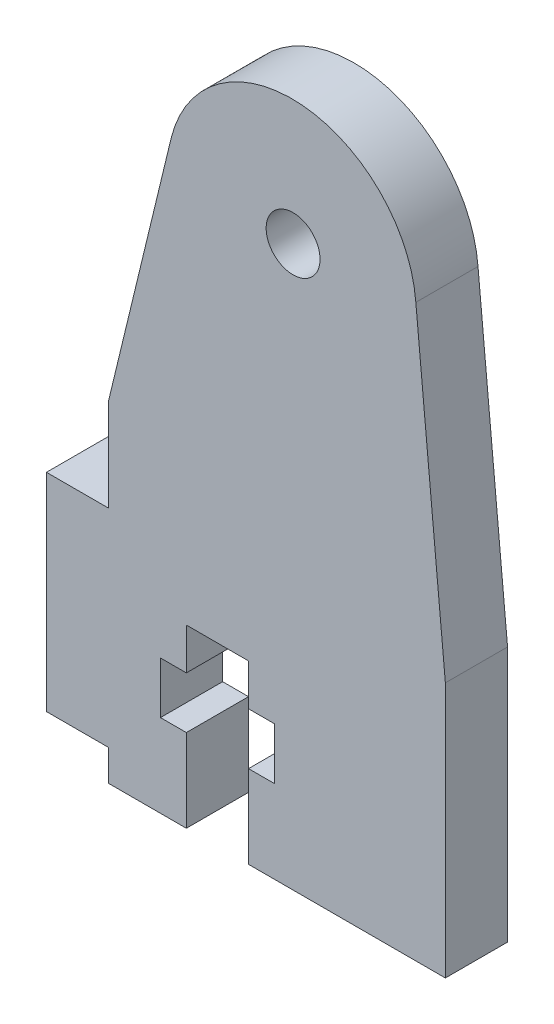
ISO-10303-21;
HEADER;
FILE_DESCRIPTION(('STEP AP214'),'2;1');
FILE_NAME('part.step','',(''),(''),'','','');
FILE_SCHEMA(('AUTOMOTIVE_DESIGN { 1 0 10303 214 1 1 1 1 }'));
ENDSEC;
DATA;
#1=APPLICATION_CONTEXT('core data for automotive mechanical design processes');
#2=APPLICATION_PROTOCOL_DEFINITION('international standard','automotive_design',2000,#1);
#3=PRODUCT_CONTEXT('',#1,'mechanical');
#4=PRODUCT('Part','Part','',(#3));
#5=PRODUCT_RELATED_PRODUCT_CATEGORY('part','',(#4));
#6=PRODUCT_DEFINITION_FORMATION('','',#4);
#7=PRODUCT_DEFINITION_CONTEXT('part definition',#1,'design');
#8=PRODUCT_DEFINITION('design','',#6,#7);
#9=PRODUCT_DEFINITION_SHAPE('','',#8);
#10=(LENGTH_UNIT() NAMED_UNIT(*) SI_UNIT(.MILLI.,.METRE.));
#11=(NAMED_UNIT(*) PLANE_ANGLE_UNIT() SI_UNIT($,.RADIAN.));
#12=(NAMED_UNIT(*) SI_UNIT($,.STERADIAN.) SOLID_ANGLE_UNIT());
#13=UNCERTAINTY_MEASURE_WITH_UNIT(LENGTH_MEASURE(1.E-05),#10,'distance_accuracy_value','');
#14=(GEOMETRIC_REPRESENTATION_CONTEXT(3) GLOBAL_UNCERTAINTY_ASSIGNED_CONTEXT((#13)) GLOBAL_UNIT_ASSIGNED_CONTEXT((#10,
#11,#12)) REPRESENTATION_CONTEXT('',''));
#15=CARTESIAN_POINT('',(0.,0.,0.));
#16=DIRECTION('',(0.,0.,1.));
#17=DIRECTION('',(1.,0.,0.));
#18=AXIS2_PLACEMENT_3D('',#15,#16,#17);
#19=CARTESIAN_POINT('',(41.2174864306805,47.5189484939746,3.));
#20=DIRECTION('',(0.,0.,1.));
#21=DIRECTION('',(1.,0.,0.));
#22=AXIS2_PLACEMENT_3D('',#19,#20,#21);
#23=PLANE('',#22);
#24=CARTESIAN_POINT('',(41.2174864306805,47.5189484939746,3.));
#25=DIRECTION('',(0.,0.,1.));
#26=DIRECTION('',(1.,0.,0.));
#27=AXIS2_PLACEMENT_3D('',#24,#25,#26);
#28=CIRCLE('',#27,6.);
#29=CARTESIAN_POINT('',(47.1981694861423,48.0000204117922,3.));
#30=VERTEX_POINT('',#29);
#31=CARTESIAN_POINT('',(35.3952496363266,48.9686238750413,3.));
#32=VERTEX_POINT('',#31);
#33=EDGE_CURVE('E258',#30,#32,#28,.T.);
#34=ORIENTED_EDGE('',*,*,#33,.T.);
#35=DIRECTION('',(-0.235113758123107,-0.971967859932225,0.));
#36=VECTOR('',#35,1.);
#37=CARTESIAN_POINT('',(32.3763825796105,36.4885300857197,3.));
#38=LINE('',#37,#36);
#39=CARTESIAN_POINT('',(32.3763825796105,36.4885300857197,3.));
#40=VERTEX_POINT('',#39);
#41=EDGE_CURVE('E136',#32,#40,#38,.T.);
#42=ORIENTED_EDGE('',*,*,#41,.T.);
#43=DIRECTION('',(0.,-1.,0.));
#44=VECTOR('',#43,1.);
#45=CARTESIAN_POINT('',(32.3763825796105,31.9885300857197,3.));
#46=LINE('',#45,#44);
#47=CARTESIAN_POINT('',(32.3763825796105,31.9885300857197,3.));
#48=VERTEX_POINT('',#47);
#49=EDGE_CURVE('E315',#40,#48,#46,.T.);
#50=ORIENTED_EDGE('',*,*,#49,.T.);
#51=DIRECTION('',(-1.,0.,0.));
#52=VECTOR('',#51,1.);
#53=CARTESIAN_POINT('',(29.3763825796057,31.9885300857197,3.));
#54=LINE('',#53,#52);
#55=CARTESIAN_POINT('',(29.3763825796057,31.9885300857197,3.));
#56=VERTEX_POINT('',#55);
#57=EDGE_CURVE('E334',#48,#56,#54,.T.);
#58=ORIENTED_EDGE('',*,*,#57,.T.);
#59=DIRECTION('',(0.,-1.,0.));
#60=VECTOR('',#59,1.);
#61=CARTESIAN_POINT('',(29.3763825796057,31.9885300857197,3.));
#62=LINE('',#61,#60);
#63=CARTESIAN_POINT('',(29.3763825796057,21.9885300857197,3.));
#64=VERTEX_POINT('',#63);
#65=EDGE_CURVE('E331',#56,#64,#62,.T.);
#66=ORIENTED_EDGE('',*,*,#65,.T.);
#67=DIRECTION('',(1.,0.,0.));
#68=VECTOR('',#67,1.);
#69=CARTESIAN_POINT('',(32.3763825796057,21.9885300857197,3.));
#70=LINE('',#69,#68);
#71=CARTESIAN_POINT('',(32.3763825796057,21.9885300857197,3.));
#72=VERTEX_POINT('',#71);
#73=EDGE_CURVE('E333',#64,#72,#70,.T.);
#74=ORIENTED_EDGE('',*,*,#73,.T.);
#75=DIRECTION('',(0.,-1.,0.));
#76=VECTOR('',#75,1.);
#77=CARTESIAN_POINT('',(32.3763825796057,20.4885300857197,3.));
#78=LINE('',#77,#76);
#79=CARTESIAN_POINT('',(32.3763825796057,20.4885300857197,3.));
#80=VERTEX_POINT('',#79);
#81=EDGE_CURVE('E336',#72,#80,#78,.T.);
#82=ORIENTED_EDGE('',*,*,#81,.T.);
#83=DIRECTION('',(1.,0.,0.));
#84=VECTOR('',#83,1.);
#85=CARTESIAN_POINT('',(32.3763825796057,20.4885300857197,3.));
#86=LINE('',#85,#84);
#87=CARTESIAN_POINT('',(36.1263825796057,20.4885300857197,3.));
#88=VERTEX_POINT('',#87);
#89=EDGE_CURVE('E342',#80,#88,#86,.T.);
#90=ORIENTED_EDGE('',*,*,#89,.T.);
#91=DIRECTION('',(0.,1.,0.));
#92=VECTOR('',#91,1.);
#93=CARTESIAN_POINT('',(36.1263825796057,20.4885300857197,3.));
#94=LINE('',#93,#92);
#95=CARTESIAN_POINT('',(36.1263825796057,24.4885300857196,3.));
#96=VERTEX_POINT('',#95);
#97=EDGE_CURVE('E344',#88,#96,#94,.T.);
#98=ORIENTED_EDGE('',*,*,#97,.T.);
#99=DIRECTION('',(-1.,0.,0.));
#100=VECTOR('',#99,1.);
#101=CARTESIAN_POINT('',(36.1263825796057,24.4885300857196,3.));
#102=LINE('',#101,#100);
#103=CARTESIAN_POINT('',(34.8763825796057,24.4885300857196,3.));
#104=VERTEX_POINT('',#103);
#105=EDGE_CURVE('E346',#96,#104,#102,.T.);
#106=ORIENTED_EDGE('',*,*,#105,.T.);
#107=DIRECTION('',(0.,1.,0.));
#108=VECTOR('',#107,1.);
#109=CARTESIAN_POINT('',(34.8763825796057,24.4885300857196,3.));
#110=LINE('',#109,#108);
#111=CARTESIAN_POINT('',(34.8763825796057,26.9810680557078,3.));
#112=VERTEX_POINT('',#111);
#113=EDGE_CURVE('E348',#104,#112,#110,.T.);
#114=ORIENTED_EDGE('',*,*,#113,.T.);
#115=DIRECTION('',(1.,0.,0.));
#116=VECTOR('',#115,1.);
#117=CARTESIAN_POINT('',(34.8763825796057,26.9810680557078,3.));
#118=LINE('',#117,#116);
#119=CARTESIAN_POINT('',(36.1263825796056,26.9810680557078,3.));
#120=VERTEX_POINT('',#119);
#121=EDGE_CURVE('E350',#112,#120,#118,.T.);
#122=ORIENTED_EDGE('',*,*,#121,.T.);
#123=DIRECTION('',(0.,1.,0.));
#124=VECTOR('',#123,1.);
#125=CARTESIAN_POINT('',(36.1263825796056,26.9810680557078,3.));
#126=LINE('',#125,#124);
#127=CARTESIAN_POINT('',(36.1263825796056,28.9810680557078,3.));
#128=VERTEX_POINT('',#127);
#129=EDGE_CURVE('E352',#120,#128,#126,.T.);
#130=ORIENTED_EDGE('',*,*,#129,.T.);
#131=DIRECTION('',(1.,0.,0.));
#132=VECTOR('',#131,1.);
#133=CARTESIAN_POINT('',(36.1263825796056,28.9810680557078,3.));
#134=LINE('',#133,#132);
#135=CARTESIAN_POINT('',(39.1263825796055,28.9810680557078,3.));
#136=VERTEX_POINT('',#135);
#137=EDGE_CURVE('E354',#128,#136,#134,.T.);
#138=ORIENTED_EDGE('',*,*,#137,.T.);
#139=DIRECTION('',(0.,-1.,0.));
#140=VECTOR('',#139,1.);
#141=CARTESIAN_POINT('',(39.1263825796055,28.9810680557078,3.));
#142=LINE('',#141,#140);
#143=CARTESIAN_POINT('',(39.1263825796055,26.9810680557077,3.));
#144=VERTEX_POINT('',#143);
#145=EDGE_CURVE('E356',#136,#144,#142,.T.);
#146=ORIENTED_EDGE('',*,*,#145,.T.);
#147=DIRECTION('',(1.,0.,0.));
#148=VECTOR('',#147,1.);
#149=CARTESIAN_POINT('',(39.1263825796055,26.9810680557077,3.));
#150=LINE('',#149,#148);
#151=CARTESIAN_POINT('',(40.3763825796055,26.9810680557077,3.));
#152=VERTEX_POINT('',#151);
#153=EDGE_CURVE('E358',#144,#152,#150,.T.);
#154=ORIENTED_EDGE('',*,*,#153,.T.);
#155=DIRECTION('',(0.,-1.,0.));
#156=VECTOR('',#155,1.);
#157=CARTESIAN_POINT('',(40.3763825796055,26.9810680557077,3.));
#158=LINE('',#157,#156);
#159=CARTESIAN_POINT('',(40.3763825796055,24.4810680557076,3.));
#160=VERTEX_POINT('',#159);
#161=EDGE_CURVE('E360',#152,#160,#158,.T.);
#162=ORIENTED_EDGE('',*,*,#161,.T.);
#163=DIRECTION('',(-1.,0.,0.));
#164=VECTOR('',#163,1.);
#165=CARTESIAN_POINT('',(40.3763825796055,24.4810680557076,3.));
#166=LINE('',#165,#164);
#167=CARTESIAN_POINT('',(39.1263825796055,24.4810680557076,3.));
#168=VERTEX_POINT('',#167);
#169=EDGE_CURVE('E362',#160,#168,#166,.T.);
#170=ORIENTED_EDGE('',*,*,#169,.T.);
#171=DIRECTION('',(0.,-1.,0.));
#172=VECTOR('',#171,1.);
#173=CARTESIAN_POINT('',(39.1263825796055,24.4810680557076,3.));
#174=LINE('',#173,#172);
#175=CARTESIAN_POINT('',(39.1263825796055,20.4810680557077,3.));
#176=VERTEX_POINT('',#175);
#177=EDGE_CURVE('E197',#168,#176,#174,.T.);
#178=ORIENTED_EDGE('',*,*,#177,.T.);
#179=DIRECTION('',(1.,0.,0.));
#180=VECTOR('',#179,1.);
#181=CARTESIAN_POINT('',(48.6236174203943,20.4810680557077,3.));
#182=LINE('',#181,#180);
#183=CARTESIAN_POINT('',(48.6236174203943,20.4810680557077,3.));
#184=VERTEX_POINT('',#183);
#185=EDGE_CURVE('E191',#176,#184,#182,.T.);
#186=ORIENTED_EDGE('',*,*,#185,.T.);
#187=DIRECTION('',(0.,1.,0.));
#188=VECTOR('',#187,1.);
#189=CARTESIAN_POINT('',(48.6236174203943,20.4810680557077,3.));
#190=LINE('',#189,#188);
#191=CARTESIAN_POINT('',(48.6236174203943,32.814680990876,3.));
#192=VERTEX_POINT('',#191);
#193=EDGE_CURVE('E195',#184,#192,#190,.T.);
#194=ORIENTED_EDGE('',*,*,#193,.T.);
#195=DIRECTION('',(-0.0934591498657765,0.995623115092436,0.));
#196=VECTOR('',#195,1.);
#197=CARTESIAN_POINT('',(48.6236174203943,32.814680990876,3.));
#198=LINE('',#197,#196);
#199=EDGE_CURVE('E51',#192,#30,#198,.T.);
#200=ORIENTED_EDGE('',*,*,#199,.T.);
#201=EDGE_LOOP('',(#34,#42,#50,#58,#66,#74,#82,#90,#98,#106,#114,#122,#130,#138,#146,#154,#162,
#170,#178,#186,#194,#200));
#202=FACE_BOUND('',#201,.T.);
#203=CARTESIAN_POINT('',(41.2763825796057,47.4885300857197,3.));
#204=DIRECTION('',(0.,0.,1.));
#205=DIRECTION('',(1.,0.,0.));
#206=AXIS2_PLACEMENT_3D('',#203,#204,#205);
#207=CIRCLE('',#206,1.3);
#208=CARTESIAN_POINT('',(42.5763825796057,47.4885300857197,3.));
#209=VERTEX_POINT('',#208);
#210=EDGE_CURVE('E219',#209,#209,#207,.T.);
#211=ORIENTED_EDGE('',*,*,#210,.F.);
#212=EDGE_LOOP('',(#211));
#213=FACE_BOUND('',#212,.T.);
#214=ADVANCED_FACE('F34',(#202,#213),#23,.T.);
#215=CARTESIAN_POINT('',(41.2174864306805,47.5189484939746,0.));
#216=DIRECTION('',(0.,0.,1.));
#217=DIRECTION('',(1.,0.,0.));
#218=AXIS2_PLACEMENT_3D('',#215,#216,#217);
#219=PLANE('',#218);
#220=CARTESIAN_POINT('',(41.2174864306805,47.5189484939746,0.));
#221=DIRECTION('',(0.,0.,1.));
#222=DIRECTION('',(1.,0.,0.));
#223=AXIS2_PLACEMENT_3D('',#220,#221,#222);
#224=CIRCLE('',#223,6.);
#225=CARTESIAN_POINT('',(47.1981694861423,48.0000204117922,0.));
#226=VERTEX_POINT('',#225);
#227=CARTESIAN_POINT('',(35.3952496363266,48.9686238750413,0.));
#228=VERTEX_POINT('',#227);
#229=EDGE_CURVE('E215',#226,#228,#224,.T.);
#230=ORIENTED_EDGE('',*,*,#229,.F.);
#231=DIRECTION('',(-0.0934591498657765,0.995623115092436,0.));
#232=VECTOR('',#231,1.);
#233=CARTESIAN_POINT('',(48.6236174203943,32.814680990876,0.));
#234=LINE('',#233,#232);
#235=CARTESIAN_POINT('',(48.6236174203943,32.814680990876,0.));
#236=VERTEX_POINT('',#235);
#237=EDGE_CURVE('E128',#236,#226,#234,.T.);
#238=ORIENTED_EDGE('',*,*,#237,.F.);
#239=DIRECTION('',(0.,1.,0.));
#240=VECTOR('',#239,1.);
#241=CARTESIAN_POINT('',(48.6236174203943,20.4810680557077,0.));
#242=LINE('',#241,#240);
#243=CARTESIAN_POINT('',(48.6236174203943,20.4810680557077,0.));
#244=VERTEX_POINT('',#243);
#245=EDGE_CURVE('E122',#244,#236,#242,.T.);
#246=ORIENTED_EDGE('',*,*,#245,.F.);
#247=DIRECTION('',(1.,0.,0.));
#248=VECTOR('',#247,1.);
#249=CARTESIAN_POINT('',(48.6236174203943,20.4810680557077,0.));
#250=LINE('',#249,#248);
#251=CARTESIAN_POINT('',(39.1263825796055,20.4810680557077,0.));
#252=VERTEX_POINT('',#251);
#253=EDGE_CURVE('E205',#252,#244,#250,.T.);
#254=ORIENTED_EDGE('',*,*,#253,.F.);
#255=DIRECTION('',(0.,-1.,0.));
#256=VECTOR('',#255,1.);
#257=CARTESIAN_POINT('',(39.1263825796055,24.4810680557076,0.));
#258=LINE('',#257,#256);
#259=CARTESIAN_POINT('',(39.1263825796055,24.4810680557076,0.));
#260=VERTEX_POINT('',#259);
#261=EDGE_CURVE('E253',#260,#252,#258,.T.);
#262=ORIENTED_EDGE('',*,*,#261,.F.);
#263=DIRECTION('',(-1.,0.,0.));
#264=VECTOR('',#263,1.);
#265=CARTESIAN_POINT('',(40.3763825796055,24.4810680557076,0.));
#266=LINE('',#265,#264);
#267=CARTESIAN_POINT('',(40.3763825796055,24.4810680557076,0.));
#268=VERTEX_POINT('',#267);
#269=EDGE_CURVE('E251',#268,#260,#266,.T.);
#270=ORIENTED_EDGE('',*,*,#269,.F.);
#271=DIRECTION('',(0.,-1.,0.));
#272=VECTOR('',#271,1.);
#273=CARTESIAN_POINT('',(40.3763825796055,26.9810680557077,0.));
#274=LINE('',#273,#272);
#275=CARTESIAN_POINT('',(40.3763825796055,26.9810680557077,0.));
#276=VERTEX_POINT('',#275);
#277=EDGE_CURVE('E249',#276,#268,#274,.T.);
#278=ORIENTED_EDGE('',*,*,#277,.F.);
#279=DIRECTION('',(1.,0.,0.));
#280=VECTOR('',#279,1.);
#281=CARTESIAN_POINT('',(39.1263825796055,26.9810680557077,0.));
#282=LINE('',#281,#280);
#283=CARTESIAN_POINT('',(39.1263825796055,26.9810680557077,0.));
#284=VERTEX_POINT('',#283);
#285=EDGE_CURVE('E247',#284,#276,#282,.T.);
#286=ORIENTED_EDGE('',*,*,#285,.F.);
#287=DIRECTION('',(0.,-1.,0.));
#288=VECTOR('',#287,1.);
#289=CARTESIAN_POINT('',(39.1263825796055,28.9810680557078,0.));
#290=LINE('',#289,#288);
#291=CARTESIAN_POINT('',(39.1263825796055,28.9810680557078,0.));
#292=VERTEX_POINT('',#291);
#293=EDGE_CURVE('E245',#292,#284,#290,.T.);
#294=ORIENTED_EDGE('',*,*,#293,.F.);
#295=DIRECTION('',(1.,0.,0.));
#296=VECTOR('',#295,1.);
#297=CARTESIAN_POINT('',(36.1263825796056,28.9810680557078,0.));
#298=LINE('',#297,#296);
#299=CARTESIAN_POINT('',(36.1263825796056,28.9810680557078,0.));
#300=VERTEX_POINT('',#299);
#301=EDGE_CURVE('E243',#300,#292,#298,.T.);
#302=ORIENTED_EDGE('',*,*,#301,.F.);
#303=DIRECTION('',(0.,1.,0.));
#304=VECTOR('',#303,1.);
#305=CARTESIAN_POINT('',(36.1263825796056,26.9810680557078,0.));
#306=LINE('',#305,#304);
#307=CARTESIAN_POINT('',(36.1263825796056,26.9810680557078,0.));
#308=VERTEX_POINT('',#307);
#309=EDGE_CURVE('E241',#308,#300,#306,.T.);
#310=ORIENTED_EDGE('',*,*,#309,.F.);
#311=DIRECTION('',(1.,0.,0.));
#312=VECTOR('',#311,1.);
#313=CARTESIAN_POINT('',(34.8763825796057,26.9810680557078,0.));
#314=LINE('',#313,#312);
#315=CARTESIAN_POINT('',(34.8763825796057,26.9810680557078,0.));
#316=VERTEX_POINT('',#315);
#317=EDGE_CURVE('E239',#316,#308,#314,.T.);
#318=ORIENTED_EDGE('',*,*,#317,.F.);
#319=DIRECTION('',(0.,1.,0.));
#320=VECTOR('',#319,1.);
#321=CARTESIAN_POINT('',(34.8763825796057,24.4885300857196,0.));
#322=LINE('',#321,#320);
#323=CARTESIAN_POINT('',(34.8763825796057,24.4885300857196,0.));
#324=VERTEX_POINT('',#323);
#325=EDGE_CURVE('E237',#324,#316,#322,.T.);
#326=ORIENTED_EDGE('',*,*,#325,.F.);
#327=DIRECTION('',(-1.,0.,0.));
#328=VECTOR('',#327,1.);
#329=CARTESIAN_POINT('',(36.1263825796057,24.4885300857196,0.));
#330=LINE('',#329,#328);
#331=CARTESIAN_POINT('',(36.1263825796057,24.4885300857196,0.));
#332=VERTEX_POINT('',#331);
#333=EDGE_CURVE('E235',#332,#324,#330,.T.);
#334=ORIENTED_EDGE('',*,*,#333,.F.);
#335=DIRECTION('',(0.,1.,0.));
#336=VECTOR('',#335,1.);
#337=CARTESIAN_POINT('',(36.1263825796057,20.4885300857197,0.));
#338=LINE('',#337,#336);
#339=CARTESIAN_POINT('',(36.1263825796057,20.4885300857197,0.));
#340=VERTEX_POINT('',#339);
#341=EDGE_CURVE('E233',#340,#332,#338,.T.);
#342=ORIENTED_EDGE('',*,*,#341,.F.);
#343=DIRECTION('',(1.,0.,0.));
#344=VECTOR('',#343,1.);
#345=CARTESIAN_POINT('',(32.3763825796057,20.4885300857197,0.));
#346=LINE('',#345,#344);
#347=CARTESIAN_POINT('',(32.3763825796057,20.4885300857197,0.));
#348=VERTEX_POINT('',#347);
#349=EDGE_CURVE('E231',#348,#340,#346,.T.);
#350=ORIENTED_EDGE('',*,*,#349,.F.);
#351=DIRECTION('',(0.,-1.,0.));
#352=VECTOR('',#351,1.);
#353=CARTESIAN_POINT('',(32.3763825796057,20.4885300857197,0.));
#354=LINE('',#353,#352);
#355=CARTESIAN_POINT('',(32.3763825796057,21.9885300857197,0.));
#356=VERTEX_POINT('',#355);
#357=EDGE_CURVE('E229',#356,#348,#354,.T.);
#358=ORIENTED_EDGE('',*,*,#357,.F.);
#359=DIRECTION('',(1.,0.,0.));
#360=VECTOR('',#359,1.);
#361=CARTESIAN_POINT('',(32.3763825796057,21.9885300857197,0.));
#362=LINE('',#361,#360);
#363=CARTESIAN_POINT('',(29.3763825796057,21.9885300857197,0.));
#364=VERTEX_POINT('',#363);
#365=EDGE_CURVE('E227',#364,#356,#362,.T.);
#366=ORIENTED_EDGE('',*,*,#365,.F.);
#367=DIRECTION('',(0.,-1.,0.));
#368=VECTOR('',#367,1.);
#369=CARTESIAN_POINT('',(29.3763825796057,31.9885300857197,0.));
#370=LINE('',#369,#368);
#371=CARTESIAN_POINT('',(29.3763825796057,31.9885300857197,0.));
#372=VERTEX_POINT('',#371);
#373=EDGE_CURVE('E225',#372,#364,#370,.T.);
#374=ORIENTED_EDGE('',*,*,#373,.F.);
#375=DIRECTION('',(-1.,0.,0.));
#376=VECTOR('',#375,1.);
#377=CARTESIAN_POINT('',(29.3763825796057,31.9885300857197,0.));
#378=LINE('',#377,#376);
#379=CARTESIAN_POINT('',(32.3763825796105,31.9885300857197,0.));
#380=VERTEX_POINT('',#379);
#381=EDGE_CURVE('E223',#380,#372,#378,.T.);
#382=ORIENTED_EDGE('',*,*,#381,.F.);
#383=DIRECTION('',(0.,-1.,0.));
#384=VECTOR('',#383,1.);
#385=CARTESIAN_POINT('',(32.3763825796105,31.9885300857197,0.));
#386=LINE('',#385,#384);
#387=CARTESIAN_POINT('',(32.3763825796105,36.4885300857197,0.));
#388=VERTEX_POINT('',#387);
#389=EDGE_CURVE('E221',#388,#380,#386,.T.);
#390=ORIENTED_EDGE('',*,*,#389,.F.);
#391=DIRECTION('',(-0.235113758123107,-0.971967859932225,0.));
#392=VECTOR('',#391,1.);
#393=CARTESIAN_POINT('',(32.3763825796105,36.4885300857197,0.));
#394=LINE('',#393,#392);
#395=EDGE_CURVE('E218',#228,#388,#394,.T.);
#396=ORIENTED_EDGE('',*,*,#395,.F.);
#397=EDGE_LOOP('',(#230,#238,#246,#254,#262,#270,#278,#286,#294,#302,#310,#318,#326,#334,#342,
#350,#358,#366,#374,#382,#390,#396));
#398=FACE_BOUND('',#397,.T.);
#399=CARTESIAN_POINT('',(41.2763825796057,47.4885300857197,0.));
#400=DIRECTION('',(0.,0.,1.));
#401=DIRECTION('',(1.,0.,0.));
#402=AXIS2_PLACEMENT_3D('',#399,#400,#401);
#403=CIRCLE('',#402,1.3);
#404=CARTESIAN_POINT('',(42.5763825796057,47.4885300857197,0.));
#405=VERTEX_POINT('',#404);
#406=EDGE_CURVE('E639',#405,#405,#403,.T.);
#407=ORIENTED_EDGE('',*,*,#406,.T.);
#408=EDGE_LOOP('',(#407));
#409=FACE_BOUND('',#408,.T.);
#410=ADVANCED_FACE('F319',(#398,#409),#219,.F.);
#411=CARTESIAN_POINT('',(41.2174864306805,47.5189484939746,3.));
#412=DIRECTION('',(0.,0.,-1.));
#413=DIRECTION('',(-1.,0.,0.));
#414=AXIS2_PLACEMENT_3D('',#411,#412,#413);
#415=CYLINDRICAL_SURFACE('',#414,6.);
#416=ORIENTED_EDGE('',*,*,#229,.T.);
#417=DIRECTION('',(0.,0.,-1.));
#418=VECTOR('',#417,1.);
#419=CARTESIAN_POINT('',(35.3952496363266,48.9686238750413,3.));
#420=LINE('',#419,#418);
#421=EDGE_CURVE('E11',#32,#228,#420,.T.);
#422=ORIENTED_EDGE('',*,*,#421,.F.);
#423=ORIENTED_EDGE('',*,*,#33,.F.);
#424=DIRECTION('',(0.,0.,-1.));
#425=VECTOR('',#424,1.);
#426=CARTESIAN_POINT('',(47.1981694861423,48.0000204117922,3.));
#427=LINE('',#426,#425);
#428=EDGE_CURVE('E211',#30,#226,#427,.T.);
#429=ORIENTED_EDGE('',*,*,#428,.T.);
#430=EDGE_LOOP('',(#416,#422,#423,#429));
#431=FACE_BOUND('',#430,.T.);
#432=ADVANCED_FACE('F36',(#431),#415,.T.);
#433=CARTESIAN_POINT('',(32.3763825796105,36.4885300857197,3.));
#434=DIRECTION('',(0.971967859932225,-0.235113758123107,0.));
#435=DIRECTION('',(0.235113758123107,0.971967859932225,0.));
#436=AXIS2_PLACEMENT_3D('',#433,#434,#435);
#437=PLANE('',#436);
#438=ORIENTED_EDGE('',*,*,#395,.T.);
#439=DIRECTION('',(0.,0.,-1.));
#440=VECTOR('',#439,1.);
#441=CARTESIAN_POINT('',(32.3763825796105,36.4885300857197,3.));
#442=LINE('',#441,#440);
#443=EDGE_CURVE('E43',#40,#388,#442,.T.);
#444=ORIENTED_EDGE('',*,*,#443,.F.);
#445=ORIENTED_EDGE('',*,*,#41,.F.);
#446=ORIENTED_EDGE('',*,*,#421,.T.);
#447=EDGE_LOOP('',(#438,#444,#445,#446));
#448=FACE_BOUND('',#447,.T.);
#449=ADVANCED_FACE('F396',(#448),#437,.F.);
#450=CARTESIAN_POINT('',(32.3763825796105,31.9885300857197,3.));
#451=DIRECTION('',(1.,0.,0.));
#452=DIRECTION('',(0.,0.,-1.));
#453=AXIS2_PLACEMENT_3D('',#450,#451,#452);
#454=PLANE('',#453);
#455=ORIENTED_EDGE('',*,*,#389,.T.);
#456=DIRECTION('',(0.,0.,-1.));
#457=VECTOR('',#456,1.);
#458=CARTESIAN_POINT('',(32.3763825796105,31.9885300857197,3.));
#459=LINE('',#458,#457);
#460=EDGE_CURVE('E307',#48,#380,#459,.T.);
#461=ORIENTED_EDGE('',*,*,#460,.F.);
#462=ORIENTED_EDGE('',*,*,#49,.F.);
#463=ORIENTED_EDGE('',*,*,#443,.T.);
#464=EDGE_LOOP('',(#455,#461,#462,#463));
#465=FACE_BOUND('',#464,.T.);
#466=ADVANCED_FACE('F313',(#465),#454,.F.);
#467=CARTESIAN_POINT('',(29.3763825796057,31.9885300857197,3.));
#468=DIRECTION('',(0.,-1.,0.));
#469=DIRECTION('',(0.,0.,-1.));
#470=AXIS2_PLACEMENT_3D('',#467,#468,#469);
#471=PLANE('',#470);
#472=ORIENTED_EDGE('',*,*,#381,.T.);
#473=DIRECTION('',(0.,0.,-1.));
#474=VECTOR('',#473,1.);
#475=CARTESIAN_POINT('',(29.3763825796057,31.9885300857197,3.));
#476=LINE('',#475,#474);
#477=EDGE_CURVE('E304',#56,#372,#476,.T.);
#478=ORIENTED_EDGE('',*,*,#477,.F.);
#479=ORIENTED_EDGE('',*,*,#57,.F.);
#480=ORIENTED_EDGE('',*,*,#460,.T.);
#481=EDGE_LOOP('',(#472,#478,#479,#480));
#482=FACE_BOUND('',#481,.T.);
#483=ADVANCED_FACE('F325',(#482),#471,.F.);
#484=CARTESIAN_POINT('',(29.3763825796057,31.9885300857197,3.));
#485=DIRECTION('',(1.,0.,0.));
#486=DIRECTION('',(0.,0.,-1.));
#487=AXIS2_PLACEMENT_3D('',#484,#485,#486);
#488=PLANE('',#487);
#489=ORIENTED_EDGE('',*,*,#373,.T.);
#490=DIRECTION('',(0.,0.,-1.));
#491=VECTOR('',#490,1.);
#492=CARTESIAN_POINT('',(29.3763825796057,21.9885300857197,3.));
#493=LINE('',#492,#491);
#494=EDGE_CURVE('E301',#64,#364,#493,.T.);
#495=ORIENTED_EDGE('',*,*,#494,.F.);
#496=ORIENTED_EDGE('',*,*,#65,.F.);
#497=ORIENTED_EDGE('',*,*,#477,.T.);
#498=EDGE_LOOP('',(#489,#495,#496,#497));
#499=FACE_BOUND('',#498,.T.);
#500=ADVANCED_FACE('F329',(#499),#488,.F.);
#501=CARTESIAN_POINT('',(32.3763825796057,21.9885300857197,3.));
#502=DIRECTION('',(0.,1.,0.));
#503=DIRECTION('',(0.,0.,1.));
#504=AXIS2_PLACEMENT_3D('',#501,#502,#503);
#505=PLANE('',#504);
#506=ORIENTED_EDGE('',*,*,#365,.T.);
#507=DIRECTION('',(0.,0.,-1.));
#508=VECTOR('',#507,1.);
#509=CARTESIAN_POINT('',(32.3763825796057,21.9885300857197,3.));
#510=LINE('',#509,#508);
#511=EDGE_CURVE('E298',#72,#356,#510,.T.);
#512=ORIENTED_EDGE('',*,*,#511,.F.);
#513=ORIENTED_EDGE('',*,*,#73,.F.);
#514=ORIENTED_EDGE('',*,*,#494,.T.);
#515=EDGE_LOOP('',(#506,#512,#513,#514));
#516=FACE_BOUND('',#515,.T.);
#517=ADVANCED_FACE('F409',(#516),#505,.F.);
#518=CARTESIAN_POINT('',(32.3763825796057,20.4885300857197,3.));
#519=DIRECTION('',(1.,0.,0.));
#520=DIRECTION('',(0.,0.,-1.));
#521=AXIS2_PLACEMENT_3D('',#518,#519,#520);
#522=PLANE('',#521);
#523=ORIENTED_EDGE('',*,*,#357,.T.);
#524=DIRECTION('',(0.,0.,-1.));
#525=VECTOR('',#524,1.);
#526=CARTESIAN_POINT('',(32.3763825796057,20.4885300857197,3.));
#527=LINE('',#526,#525);
#528=EDGE_CURVE('E295',#80,#348,#527,.T.);
#529=ORIENTED_EDGE('',*,*,#528,.F.);
#530=ORIENTED_EDGE('',*,*,#81,.F.);
#531=ORIENTED_EDGE('',*,*,#511,.T.);
#532=EDGE_LOOP('',(#523,#529,#530,#531));
#533=FACE_BOUND('',#532,.T.);
#534=ADVANCED_FACE('F412',(#533),#522,.F.);
#535=CARTESIAN_POINT('',(32.3763825796057,20.4885300857197,3.));
#536=DIRECTION('',(0.,1.,0.));
#537=DIRECTION('',(0.,0.,1.));
#538=AXIS2_PLACEMENT_3D('',#535,#536,#537);
#539=PLANE('',#538);
#540=ORIENTED_EDGE('',*,*,#349,.T.);
#541=DIRECTION('',(0.,0.,-1.));
#542=VECTOR('',#541,1.);
#543=CARTESIAN_POINT('',(36.1263825796057,20.4885300857197,3.));
#544=LINE('',#543,#542);
#545=EDGE_CURVE('E292',#88,#340,#544,.T.);
#546=ORIENTED_EDGE('',*,*,#545,.F.);
#547=ORIENTED_EDGE('',*,*,#89,.F.);
#548=ORIENTED_EDGE('',*,*,#528,.T.);
#549=EDGE_LOOP('',(#540,#546,#547,#548));
#550=FACE_BOUND('',#549,.T.);
#551=ADVANCED_FACE('F416',(#550),#539,.F.);
#552=CARTESIAN_POINT('',(36.1263825796057,20.4885300857197,3.));
#553=DIRECTION('',(-1.,0.,0.));
#554=DIRECTION('',(0.,0.,1.));
#555=AXIS2_PLACEMENT_3D('',#552,#553,#554);
#556=PLANE('',#555);
#557=ORIENTED_EDGE('',*,*,#341,.T.);
#558=DIRECTION('',(0.,0.,-1.));
#559=VECTOR('',#558,1.);
#560=CARTESIAN_POINT('',(36.1263825796057,24.4885300857196,3.));
#561=LINE('',#560,#559);
#562=EDGE_CURVE('E289',#96,#332,#561,.T.);
#563=ORIENTED_EDGE('',*,*,#562,.F.);
#564=ORIENTED_EDGE('',*,*,#97,.F.);
#565=ORIENTED_EDGE('',*,*,#545,.T.);
#566=EDGE_LOOP('',(#557,#563,#564,#565));
#567=FACE_BOUND('',#566,.T.);
#568=ADVANCED_FACE('F420',(#567),#556,.F.);
#569=CARTESIAN_POINT('',(36.1263825796057,24.4885300857196,3.));
#570=DIRECTION('',(0.,-1.,0.));
#571=DIRECTION('',(0.,0.,-1.));
#572=AXIS2_PLACEMENT_3D('',#569,#570,#571);
#573=PLANE('',#572);
#574=ORIENTED_EDGE('',*,*,#333,.T.);
#575=DIRECTION('',(0.,0.,-1.));
#576=VECTOR('',#575,1.);
#577=CARTESIAN_POINT('',(34.8763825796057,24.4885300857196,3.));
#578=LINE('',#577,#576);
#579=EDGE_CURVE('E286',#104,#324,#578,.T.);
#580=ORIENTED_EDGE('',*,*,#579,.F.);
#581=ORIENTED_EDGE('',*,*,#105,.F.);
#582=ORIENTED_EDGE('',*,*,#562,.T.);
#583=EDGE_LOOP('',(#574,#580,#581,#582));
#584=FACE_BOUND('',#583,.T.);
#585=ADVANCED_FACE('F424',(#584),#573,.F.);
#586=CARTESIAN_POINT('',(34.8763825796057,24.4885300857196,3.));
#587=DIRECTION('',(-1.,0.,0.));
#588=DIRECTION('',(0.,0.,1.));
#589=AXIS2_PLACEMENT_3D('',#586,#587,#588);
#590=PLANE('',#589);
#591=ORIENTED_EDGE('',*,*,#325,.T.);
#592=DIRECTION('',(0.,0.,-1.));
#593=VECTOR('',#592,1.);
#594=CARTESIAN_POINT('',(34.8763825796057,26.9810680557078,3.));
#595=LINE('',#594,#593);
#596=EDGE_CURVE('E283',#112,#316,#595,.T.);
#597=ORIENTED_EDGE('',*,*,#596,.F.);
#598=ORIENTED_EDGE('',*,*,#113,.F.);
#599=ORIENTED_EDGE('',*,*,#579,.T.);
#600=EDGE_LOOP('',(#591,#597,#598,#599));
#601=FACE_BOUND('',#600,.T.);
#602=ADVANCED_FACE('F428',(#601),#590,.F.);
#603=CARTESIAN_POINT('',(34.8763825796057,26.9810680557078,3.));
#604=DIRECTION('',(0.,1.,0.));
#605=DIRECTION('',(0.,0.,1.));
#606=AXIS2_PLACEMENT_3D('',#603,#604,#605);
#607=PLANE('',#606);
#608=ORIENTED_EDGE('',*,*,#317,.T.);
#609=DIRECTION('',(0.,0.,-1.));
#610=VECTOR('',#609,1.);
#611=CARTESIAN_POINT('',(36.1263825796056,26.9810680557078,3.));
#612=LINE('',#611,#610);
#613=EDGE_CURVE('E280',#120,#308,#612,.T.);
#614=ORIENTED_EDGE('',*,*,#613,.F.);
#615=ORIENTED_EDGE('',*,*,#121,.F.);
#616=ORIENTED_EDGE('',*,*,#596,.T.);
#617=EDGE_LOOP('',(#608,#614,#615,#616));
#618=FACE_BOUND('',#617,.T.);
#619=ADVANCED_FACE('F432',(#618),#607,.F.);
#620=CARTESIAN_POINT('',(36.1263825796056,26.9810680557078,3.));
#621=DIRECTION('',(-1.,0.,0.));
#622=DIRECTION('',(0.,0.,1.));
#623=AXIS2_PLACEMENT_3D('',#620,#621,#622);
#624=PLANE('',#623);
#625=ORIENTED_EDGE('',*,*,#309,.T.);
#626=DIRECTION('',(0.,0.,-1.));
#627=VECTOR('',#626,1.);
#628=CARTESIAN_POINT('',(36.1263825796056,28.9810680557078,3.));
#629=LINE('',#628,#627);
#630=EDGE_CURVE('E277',#128,#300,#629,.T.);
#631=ORIENTED_EDGE('',*,*,#630,.F.);
#632=ORIENTED_EDGE('',*,*,#129,.F.);
#633=ORIENTED_EDGE('',*,*,#613,.T.);
#634=EDGE_LOOP('',(#625,#631,#632,#633));
#635=FACE_BOUND('',#634,.T.);
#636=ADVANCED_FACE('F436',(#635),#624,.F.);
#637=CARTESIAN_POINT('',(36.1263825796056,28.9810680557078,3.));
#638=DIRECTION('',(0.,1.,0.));
#639=DIRECTION('',(0.,0.,1.));
#640=AXIS2_PLACEMENT_3D('',#637,#638,#639);
#641=PLANE('',#640);
#642=ORIENTED_EDGE('',*,*,#301,.T.);
#643=DIRECTION('',(0.,0.,-1.));
#644=VECTOR('',#643,1.);
#645=CARTESIAN_POINT('',(39.1263825796055,28.9810680557078,3.));
#646=LINE('',#645,#644);
#647=EDGE_CURVE('E274',#136,#292,#646,.T.);
#648=ORIENTED_EDGE('',*,*,#647,.F.);
#649=ORIENTED_EDGE('',*,*,#137,.F.);
#650=ORIENTED_EDGE('',*,*,#630,.T.);
#651=EDGE_LOOP('',(#642,#648,#649,#650));
#652=FACE_BOUND('',#651,.T.);
#653=ADVANCED_FACE('F440',(#652),#641,.F.);
#654=CARTESIAN_POINT('',(39.1263825796055,28.9810680557078,3.));
#655=DIRECTION('',(1.,0.,0.));
#656=DIRECTION('',(0.,0.,-1.));
#657=AXIS2_PLACEMENT_3D('',#654,#655,#656);
#658=PLANE('',#657);
#659=ORIENTED_EDGE('',*,*,#293,.T.);
#660=DIRECTION('',(0.,0.,-1.));
#661=VECTOR('',#660,1.);
#662=CARTESIAN_POINT('',(39.1263825796055,26.9810680557077,3.));
#663=LINE('',#662,#661);
#664=EDGE_CURVE('E271',#144,#284,#663,.T.);
#665=ORIENTED_EDGE('',*,*,#664,.F.);
#666=ORIENTED_EDGE('',*,*,#145,.F.);
#667=ORIENTED_EDGE('',*,*,#647,.T.);
#668=EDGE_LOOP('',(#659,#665,#666,#667));
#669=FACE_BOUND('',#668,.T.);
#670=ADVANCED_FACE('F444',(#669),#658,.F.);
#671=CARTESIAN_POINT('',(39.1263825796055,26.9810680557077,3.));
#672=DIRECTION('',(0.,1.,0.));
#673=DIRECTION('',(0.,0.,1.));
#674=AXIS2_PLACEMENT_3D('',#671,#672,#673);
#675=PLANE('',#674);
#676=ORIENTED_EDGE('',*,*,#285,.T.);
#677=DIRECTION('',(0.,0.,-1.));
#678=VECTOR('',#677,1.);
#679=CARTESIAN_POINT('',(40.3763825796055,26.9810680557077,3.));
#680=LINE('',#679,#678);
#681=EDGE_CURVE('E268',#152,#276,#680,.T.);
#682=ORIENTED_EDGE('',*,*,#681,.F.);
#683=ORIENTED_EDGE('',*,*,#153,.F.);
#684=ORIENTED_EDGE('',*,*,#664,.T.);
#685=EDGE_LOOP('',(#676,#682,#683,#684));
#686=FACE_BOUND('',#685,.T.);
#687=ADVANCED_FACE('F448',(#686),#675,.F.);
#688=CARTESIAN_POINT('',(40.3763825796055,26.9810680557077,3.));
#689=DIRECTION('',(1.,0.,0.));
#690=DIRECTION('',(0.,0.,-1.));
#691=AXIS2_PLACEMENT_3D('',#688,#689,#690);
#692=PLANE('',#691);
#693=ORIENTED_EDGE('',*,*,#277,.T.);
#694=DIRECTION('',(0.,0.,-1.));
#695=VECTOR('',#694,1.);
#696=CARTESIAN_POINT('',(40.3763825796055,24.4810680557076,3.));
#697=LINE('',#696,#695);
#698=EDGE_CURVE('E265',#160,#268,#697,.T.);
#699=ORIENTED_EDGE('',*,*,#698,.F.);
#700=ORIENTED_EDGE('',*,*,#161,.F.);
#701=ORIENTED_EDGE('',*,*,#681,.T.);
#702=EDGE_LOOP('',(#693,#699,#700,#701));
#703=FACE_BOUND('',#702,.T.);
#704=ADVANCED_FACE('F452',(#703),#692,.F.);
#705=CARTESIAN_POINT('',(40.3763825796055,24.4810680557076,3.));
#706=DIRECTION('',(0.,-1.,0.));
#707=DIRECTION('',(0.,0.,-1.));
#708=AXIS2_PLACEMENT_3D('',#705,#706,#707);
#709=PLANE('',#708);
#710=ORIENTED_EDGE('',*,*,#269,.T.);
#711=DIRECTION('',(0.,0.,-1.));
#712=VECTOR('',#711,1.);
#713=CARTESIAN_POINT('',(39.1263825796055,24.4810680557076,3.));
#714=LINE('',#713,#712);
#715=EDGE_CURVE('E262',#168,#260,#714,.T.);
#716=ORIENTED_EDGE('',*,*,#715,.F.);
#717=ORIENTED_EDGE('',*,*,#169,.F.);
#718=ORIENTED_EDGE('',*,*,#698,.T.);
#719=EDGE_LOOP('',(#710,#716,#717,#718));
#720=FACE_BOUND('',#719,.T.);
#721=ADVANCED_FACE('F368',(#720),#709,.F.);
#722=CARTESIAN_POINT('',(39.1263825796055,24.4810680557076,3.));
#723=DIRECTION('',(1.,0.,0.));
#724=DIRECTION('',(0.,0.,-1.));
#725=AXIS2_PLACEMENT_3D('',#722,#723,#724);
#726=PLANE('',#725);
#727=ORIENTED_EDGE('',*,*,#261,.T.);
#728=DIRECTION('',(0.,0.,-1.));
#729=VECTOR('',#728,1.);
#730=CARTESIAN_POINT('',(39.1263825796055,20.4810680557077,3.));
#731=LINE('',#730,#729);
#732=EDGE_CURVE('E206',#176,#252,#731,.T.);
#733=ORIENTED_EDGE('',*,*,#732,.F.);
#734=ORIENTED_EDGE('',*,*,#177,.F.);
#735=ORIENTED_EDGE('',*,*,#715,.T.);
#736=EDGE_LOOP('',(#727,#733,#734,#735));
#737=FACE_BOUND('',#736,.T.);
#738=ADVANCED_FACE('F372',(#737),#726,.F.);
#739=CARTESIAN_POINT('',(48.6236174203943,20.4810680557077,3.));
#740=DIRECTION('',(0.,1.,0.));
#741=DIRECTION('',(0.,0.,1.));
#742=AXIS2_PLACEMENT_3D('',#739,#740,#741);
#743=PLANE('',#742);
#744=ORIENTED_EDGE('',*,*,#253,.T.);
#745=DIRECTION('',(0.,0.,-1.));
#746=VECTOR('',#745,1.);
#747=CARTESIAN_POINT('',(48.6236174203943,20.4810680557077,3.));
#748=LINE('',#747,#746);
#749=EDGE_CURVE('E202',#184,#244,#748,.T.);
#750=ORIENTED_EDGE('',*,*,#749,.F.);
#751=ORIENTED_EDGE('',*,*,#185,.F.);
#752=ORIENTED_EDGE('',*,*,#732,.T.);
#753=EDGE_LOOP('',(#744,#750,#751,#752));
#754=FACE_BOUND('',#753,.T.);
#755=ADVANCED_FACE('F203',(#754),#743,.F.);
#756=CARTESIAN_POINT('',(48.6236174203943,20.4810680557077,3.));
#757=DIRECTION('',(-1.,0.,0.));
#758=DIRECTION('',(0.,0.,1.));
#759=AXIS2_PLACEMENT_3D('',#756,#757,#758);
#760=PLANE('',#759);
#761=ORIENTED_EDGE('',*,*,#245,.T.);
#762=DIRECTION('',(0.,0.,-1.));
#763=VECTOR('',#762,1.);
#764=CARTESIAN_POINT('',(48.6236174203943,32.814680990876,3.));
#765=LINE('',#764,#763);
#766=EDGE_CURVE('E207',#192,#236,#765,.T.);
#767=ORIENTED_EDGE('',*,*,#766,.F.);
#768=ORIENTED_EDGE('',*,*,#193,.F.);
#769=ORIENTED_EDGE('',*,*,#749,.T.);
#770=EDGE_LOOP('',(#761,#767,#768,#769));
#771=FACE_BOUND('',#770,.T.);
#772=ADVANCED_FACE('F209',(#771),#760,.F.);
#773=CARTESIAN_POINT('',(48.6236174203943,32.814680990876,3.));
#774=DIRECTION('',(-0.995623115092436,-0.0934591498657765,0.));
#775=DIRECTION('',(0.0934591498657765,-0.995623115092436,0.));
#776=AXIS2_PLACEMENT_3D('',#773,#774,#775);
#777=PLANE('',#776);
#778=ORIENTED_EDGE('',*,*,#237,.T.);
#779=ORIENTED_EDGE('',*,*,#428,.F.);
#780=ORIENTED_EDGE('',*,*,#199,.F.);
#781=ORIENTED_EDGE('',*,*,#766,.T.);
#782=EDGE_LOOP('',(#778,#779,#780,#781));
#783=FACE_BOUND('',#782,.T.);
#784=ADVANCED_FACE('F376',(#783),#777,.F.);
#785=CARTESIAN_POINT('',(41.2763825796057,47.4885300857197,3.));
#786=DIRECTION('',(0.,0.,-1.));
#787=DIRECTION('',(-1.,0.,0.));
#788=AXIS2_PLACEMENT_3D('',#785,#786,#787);
#789=CYLINDRICAL_SURFACE('',#788,1.3);
#790=ORIENTED_EDGE('',*,*,#210,.T.);
#791=EDGE_LOOP('',(#790));
#792=FACE_BOUND('',#791,.T.);
#793=ORIENTED_EDGE('',*,*,#406,.F.);
#794=EDGE_LOOP('',(#793));
#795=FACE_BOUND('',#794,.T.);
#796=ADVANCED_FACE('F378',(#792,#795),#789,.F.);
#797=CLOSED_SHELL('',(#214,#410,#432,#449,#466,#483,#500,#517,#534,#551,#568,#585,#602,#619,
#636,#653,#670,#687,#704,#721,#738,#755,#772,#784,#796));
#798=MANIFOLD_SOLID_BREP('B2',#797);
#799=ADVANCED_BREP_SHAPE_REPRESENTATION('',(#18,#798),#14);
#800=SHAPE_DEFINITION_REPRESENTATION(#9,#799);
ENDSEC;
END-ISO-10303-21;
